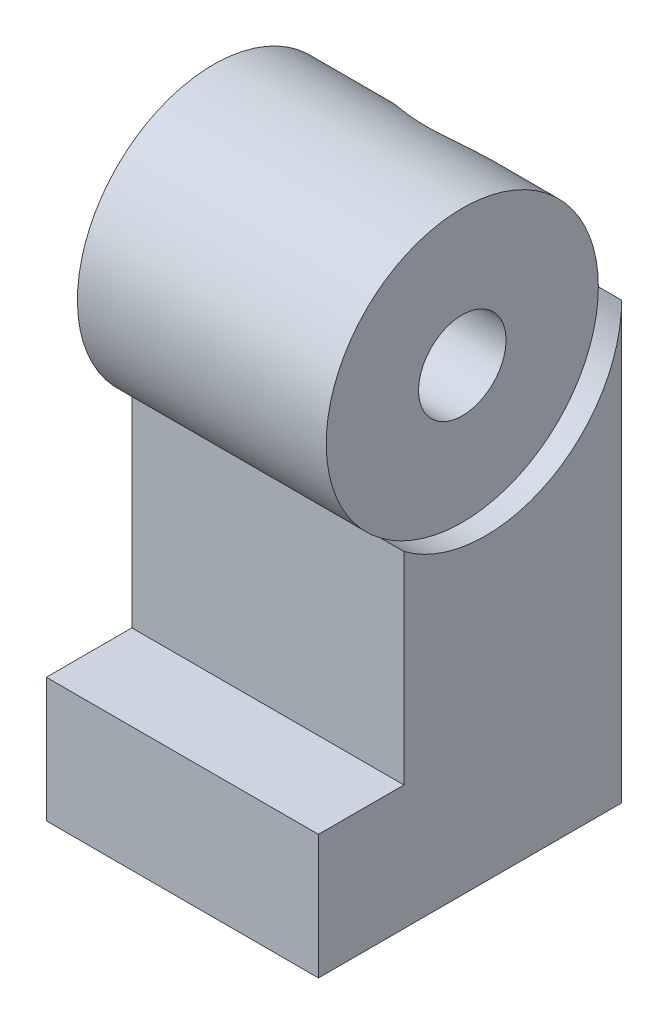
ISO-10303-21;
HEADER;
FILE_DESCRIPTION(('STEP AP214'),'2;1');
FILE_NAME('part.step','',(''),(''),'','','');
FILE_SCHEMA(('AUTOMOTIVE_DESIGN { 1 0 10303 214 1 1 1 1 }'));
ENDSEC;
DATA;
#1=APPLICATION_CONTEXT('core data for automotive mechanical design processes');
#2=APPLICATION_PROTOCOL_DEFINITION('international standard','automotive_design',2000,#1);
#3=PRODUCT_CONTEXT('',#1,'mechanical');
#4=PRODUCT('Part','Part','',(#3));
#5=PRODUCT_RELATED_PRODUCT_CATEGORY('part','',(#4));
#6=PRODUCT_DEFINITION_FORMATION('','',#4);
#7=PRODUCT_DEFINITION_CONTEXT('part definition',#1,'design');
#8=PRODUCT_DEFINITION('design','',#6,#7);
#9=PRODUCT_DEFINITION_SHAPE('','',#8);
#10=(LENGTH_UNIT() NAMED_UNIT(*) SI_UNIT(.MILLI.,.METRE.));
#11=(NAMED_UNIT(*) PLANE_ANGLE_UNIT() SI_UNIT($,.RADIAN.));
#12=(NAMED_UNIT(*) SI_UNIT($,.STERADIAN.) SOLID_ANGLE_UNIT());
#13=UNCERTAINTY_MEASURE_WITH_UNIT(LENGTH_MEASURE(1.E-05),#10,'distance_accuracy_value','');
#14=(GEOMETRIC_REPRESENTATION_CONTEXT(3) GLOBAL_UNCERTAINTY_ASSIGNED_CONTEXT((#13)) GLOBAL_UNIT_ASSIGNED_CONTEXT((#10,
#11,#12)) REPRESENTATION_CONTEXT('',''));
#15=CARTESIAN_POINT('',(0.,0.,0.));
#16=DIRECTION('',(0.,0.,1.));
#17=DIRECTION('',(1.,0.,0.));
#18=AXIS2_PLACEMENT_3D('',#15,#16,#17);
#19=CARTESIAN_POINT('',(-10.5,0.500000000000002,-1.7));
#20=DIRECTION('',(0.,0.,-1.));
#21=DIRECTION('',(0.,1.,0.));
#22=AXIS2_PLACEMENT_3D('',#19,#20,#21);
#23=PLANE('',#22);
#24=DIRECTION('',(1.,0.,0.));
#25=VECTOR('',#24,1.);
#26=CARTESIAN_POINT('',(-14.,2.2,-1.7));
#27=LINE('',#26,#25);
#28=CARTESIAN_POINT('',(-12.1941074346097,2.2,-1.7));
#29=VERTEX_POINT('',#28);
#30=CARTESIAN_POINT('',(-9.49410743460974,2.2,-1.7));
#31=VERTEX_POINT('',#30);
#32=EDGE_CURVE('E194',#29,#31,#27,.T.);
#33=ORIENTED_EDGE('',*,*,#32,.F.);
#34=CARTESIAN_POINT('',(-10.5,0.500000000000002,-1.7));
#35=DIRECTION('',(0.,0.,1.));
#36=DIRECTION('',(0.,1.,0.));
#37=AXIS2_PLACEMENT_3D('',#34,#35,#36);
#38=CIRCLE('',#37,2.4);
#39=CARTESIAN_POINT('',(-9.49410743460974,-1.67903192883734,-1.7));
#40=VERTEX_POINT('',#39);
#41=EDGE_CURVE('E196',#40,#29,#38,.T.);
#42=ORIENTED_EDGE('',*,*,#41,.F.);
#43=DIRECTION('',(0.,-1.,0.));
#44=VECTOR('',#43,1.);
#45=CARTESIAN_POINT('',(-9.49410743460974,0.,-1.7));
#46=LINE('',#45,#44);
#47=EDGE_CURVE('E186',#31,#40,#46,.T.);
#48=ORIENTED_EDGE('',*,*,#47,.F.);
#49=EDGE_LOOP('',(#33,#42,#48));
#50=FACE_BOUND('',#49,.T.);
#51=ADVANCED_FACE('F39',(#50),#23,.T.);
#52=CARTESIAN_POINT('',(-14.,-2.3,-1.8));
#53=DIRECTION('',(0.,0.,-1.));
#54=DIRECTION('',(0.,1.,0.));
#55=AXIS2_PLACEMENT_3D('',#52,#53,#54);
#56=PLANE('',#55);
#57=DIRECTION('',(0.,-1.,0.));
#58=VECTOR('',#57,1.);
#59=CARTESIAN_POINT('',(-12.9,-2.3,-1.8));
#60=LINE('',#59,#58);
#61=CARTESIAN_POINT('',(-12.9,-7.3,-1.8));
#62=VERTEX_POINT('',#61);
#63=CARTESIAN_POINT('',(-12.9,-11.2,-1.8));
#64=VERTEX_POINT('',#63);
#65=EDGE_CURVE('E452',#62,#64,#60,.T.);
#66=ORIENTED_EDGE('',*,*,#65,.T.);
#67=DIRECTION('',(-1.,0.,0.));
#68=VECTOR('',#67,1.);
#69=CARTESIAN_POINT('',(-14.,-11.2,-1.8));
#70=LINE('',#69,#68);
#71=CARTESIAN_POINT('',(-8.1,-11.2,-1.8));
#72=VERTEX_POINT('',#71);
#73=EDGE_CURVE('E468',#72,#64,#70,.T.);
#74=ORIENTED_EDGE('',*,*,#73,.F.);
#75=DIRECTION('',(0.,-1.,0.));
#76=VECTOR('',#75,1.);
#77=CARTESIAN_POINT('',(-8.1,-2.3,-1.8));
#78=LINE('',#77,#76);
#79=CARTESIAN_POINT('',(-8.1,-7.3,-1.8));
#80=VERTEX_POINT('',#79);
#81=EDGE_CURVE('E458',#80,#72,#78,.T.);
#82=ORIENTED_EDGE('',*,*,#81,.F.);
#83=CARTESIAN_POINT('',(-10.5,-7.3,-1.8));
#84=DIRECTION('',(0.,0.,1.));
#85=DIRECTION('',(0.,1.,0.));
#86=AXIS2_PLACEMENT_3D('',#83,#84,#85);
#87=CIRCLE('',#86,2.4);
#88=EDGE_CURVE('E289',#62,#80,#87,.T.);
#89=ORIENTED_EDGE('',*,*,#88,.F.);
#90=EDGE_LOOP('',(#66,#74,#82,#89));
#91=FACE_BOUND('',#90,.T.);
#92=ADVANCED_FACE('F250',(#91),#56,.F.);
#93=CARTESIAN_POINT('',(-7.,-11.2,0.));
#94=DIRECTION('',(0.,1.,0.));
#95=DIRECTION('',(0.,0.,1.));
#96=AXIS2_PLACEMENT_3D('',#93,#94,#95);
#97=PLANE('',#96);
#98=DIRECTION('',(0.,0.,1.));
#99=VECTOR('',#98,1.);
#100=CARTESIAN_POINT('',(-14.,-11.2,0.));
#101=LINE('',#100,#99);
#102=CARTESIAN_POINT('',(-14.,-11.2,-3.5));
#103=VERTEX_POINT('',#102);
#104=CARTESIAN_POINT('',(-14.,-11.2,4.3));
#105=VERTEX_POINT('',#104);
#106=EDGE_CURVE('E423',#103,#105,#101,.T.);
#107=ORIENTED_EDGE('',*,*,#106,.F.);
#108=DIRECTION('',(-1.,0.,0.));
#109=VECTOR('',#108,1.);
#110=CARTESIAN_POINT('',(-7.,-11.2,-3.5));
#111=LINE('',#110,#109);
#112=CARTESIAN_POINT('',(-7.,-11.2,-3.5));
#113=VERTEX_POINT('',#112);
#114=EDGE_CURVE('E382',#113,#103,#111,.T.);
#115=ORIENTED_EDGE('',*,*,#114,.F.);
#116=DIRECTION('',(0.,0.,1.));
#117=VECTOR('',#116,1.);
#118=CARTESIAN_POINT('',(-7.,-11.2,0.));
#119=LINE('',#118,#117);
#120=CARTESIAN_POINT('',(-7.,-11.2,4.3));
#121=VERTEX_POINT('',#120);
#122=EDGE_CURVE('E425',#113,#121,#119,.T.);
#123=ORIENTED_EDGE('',*,*,#122,.T.);
#124=DIRECTION('',(-1.,0.,0.));
#125=VECTOR('',#124,1.);
#126=CARTESIAN_POINT('',(-7.,-11.2,4.3));
#127=LINE('',#126,#125);
#128=EDGE_CURVE('E385',#121,#105,#127,.T.);
#129=ORIENTED_EDGE('',*,*,#128,.T.);
#130=EDGE_LOOP('',(#107,#115,#123,#129));
#131=FACE_BOUND('',#130,.T.);
#132=DIRECTION('',(0.,0.,1.));
#133=VECTOR('',#132,1.);
#134=CARTESIAN_POINT('',(-8.1,-11.2,0.));
#135=LINE('',#134,#133);
#136=CARTESIAN_POINT('',(-8.1,-11.2,2.9));
#137=VERTEX_POINT('',#136);
#138=EDGE_CURVE('E461',#72,#137,#135,.T.);
#139=ORIENTED_EDGE('',*,*,#138,.F.);
#140=ORIENTED_EDGE('',*,*,#73,.T.);
#141=DIRECTION('',(0.,0.,1.));
#142=VECTOR('',#141,1.);
#143=CARTESIAN_POINT('',(-12.9,-11.2,0.));
#144=LINE('',#143,#142);
#145=CARTESIAN_POINT('',(-12.9,-11.2,2.9));
#146=VERTEX_POINT('',#145);
#147=EDGE_CURVE('E465',#64,#146,#144,.T.);
#148=ORIENTED_EDGE('',*,*,#147,.T.);
#149=DIRECTION('',(-1.,0.,0.));
#150=VECTOR('',#149,1.);
#151=CARTESIAN_POINT('',(-14.,-11.2,2.9));
#152=LINE('',#151,#150);
#153=EDGE_CURVE('E297',#137,#146,#152,.T.);
#154=ORIENTED_EDGE('',*,*,#153,.F.);
#155=EDGE_LOOP('',(#139,#140,#148,#154));
#156=FACE_BOUND('',#155,.T.);
#157=ADVANCED_FACE('F256',(#131,#156),#97,.F.);
#158=CARTESIAN_POINT('',(-14.,-2.3,1.5));
#159=DIRECTION('',(0.,0.,-1.));
#160=DIRECTION('',(0.,1.,0.));
#161=AXIS2_PLACEMENT_3D('',#158,#159,#160);
#162=PLANE('',#161);
#163=DIRECTION('',(0.,-1.,0.));
#164=VECTOR('',#163,1.);
#165=CARTESIAN_POINT('',(-12.9,-2.3,1.5));
#166=LINE('',#165,#164);
#167=CARTESIAN_POINT('',(-12.9,-2.3,1.5));
#168=VERTEX_POINT('',#167);
#169=CARTESIAN_POINT('',(-12.9,-9.2,1.5));
#170=VERTEX_POINT('',#169);
#171=EDGE_CURVE('E451',#168,#170,#166,.T.);
#172=ORIENTED_EDGE('',*,*,#171,.F.);
#173=DIRECTION('',(-1.,0.,0.));
#174=VECTOR('',#173,1.);
#175=CARTESIAN_POINT('',(-14.,-2.3,1.5));
#176=LINE('',#175,#174);
#177=CARTESIAN_POINT('',(-8.1,-2.3,1.5));
#178=VERTEX_POINT('',#177);
#179=EDGE_CURVE('E474',#178,#168,#176,.T.);
#180=ORIENTED_EDGE('',*,*,#179,.F.);
#181=DIRECTION('',(0.,-1.,0.));
#182=VECTOR('',#181,1.);
#183=CARTESIAN_POINT('',(-8.1,-2.3,1.5));
#184=LINE('',#183,#182);
#185=CARTESIAN_POINT('',(-8.1,-9.2,1.5));
#186=VERTEX_POINT('',#185);
#187=EDGE_CURVE('E455',#178,#186,#184,.T.);
#188=ORIENTED_EDGE('',*,*,#187,.T.);
#189=DIRECTION('',(-1.,0.,0.));
#190=VECTOR('',#189,1.);
#191=CARTESIAN_POINT('',(-14.,-9.2,1.5));
#192=LINE('',#191,#190);
#193=EDGE_CURVE('E298',#186,#170,#192,.T.);
#194=ORIENTED_EDGE('',*,*,#193,.T.);
#195=EDGE_LOOP('',(#172,#180,#188,#194));
#196=FACE_BOUND('',#195,.T.);
#197=ADVANCED_FACE('F320',(#196),#162,.T.);
#198=CARTESIAN_POINT('',(-7.6,0.,0.));
#199=DIRECTION('',(-1.,0.,0.));
#200=DIRECTION('',(0.,0.,-1.));
#201=AXIS2_PLACEMENT_3D('',#198,#199,#200);
#202=CYLINDRICAL_SURFACE('',#201,3.5);
#203=CARTESIAN_POINT('',(-8.1526610811389,0.,-3.5));
#204=CARTESIAN_POINT('',(-8.14047675200788,0.0571477217374245,-3.50001181867057));
#205=CARTESIAN_POINT('',(-8.13040136066602,0.114743770065322,-3.49860061614223));
#206=CARTESIAN_POINT('',(-8.11448439571622,0.230360407827148,-3.49288728833139));
#207=CARTESIAN_POINT('',(-8.10864171215917,0.288380881929227,-3.48858592151156));
#208=CARTESIAN_POINT('',(-8.1012199261076,0.404089359673819,-3.47707880110764));
#209=CARTESIAN_POINT('',(-8.09961781879924,0.461777456069779,-3.46988896332483));
#210=CARTESIAN_POINT('',(-8.10053621615343,0.576676567862824,-3.45265487837301));
#211=CARTESIAN_POINT('',(-8.10305673592038,0.633887581511211,-3.44261062074615));
#212=CARTESIAN_POINT('',(-8.11663404443771,0.804105036209103,-3.4083356117771));
#213=CARTESIAN_POINT('',(-8.13369615772365,0.915869866292524,-3.37994514796454));
#214=CARTESIAN_POINT('',(-8.1823353397836,1.13314832429677,-3.31344895138059));
#215=CARTESIAN_POINT('',(-8.21392769463075,1.23865523648251,-3.27533300607753));
#216=CARTESIAN_POINT('',(-8.29190508371705,1.44731564674367,-3.18884504357403));
#217=CARTESIAN_POINT('',(-8.33902161100718,1.55000373794561,-3.14001706082533));
#218=CARTESIAN_POINT('',(-8.44532329958775,1.74526360748642,-3.03584021966201));
#219=CARTESIAN_POINT('',(-8.50451350227335,1.83783113507598,-2.98048864139242));
#220=CARTESIAN_POINT('',(-8.64646426223189,2.03018562272158,-2.85379750966277));
#221=CARTESIAN_POINT('',(-8.73157013043013,2.12760502281981,-2.78149734246403));
#222=CARTESIAN_POINT('',(-8.91528339944795,2.30698502977076,-2.63462775579363));
#223=CARTESIAN_POINT('',(-9.01390834423533,2.38892521486053,-2.56005548720432));
#224=CARTESIAN_POINT('',(-9.21673536669363,2.53162908276111,-2.41871956278776));
#225=CARTESIAN_POINT('',(-9.32004698623315,2.59348192527748,-2.3517770338946));
#226=CARTESIAN_POINT('',(-9.53861548919004,2.70240840583052,-2.22572729179699));
#227=CARTESIAN_POINT('',(-9.65384596463766,2.74951382379002,-2.16660339102304));
#228=CARTESIAN_POINT('',(-9.85227242287299,2.81234304649958,-2.08383834027692));
#229=CARTESIAN_POINT('',(-9.93168132527571,2.83323788763357,-2.05514190190293));
#230=CARTESIAN_POINT('',(-10.0950061812703,2.86704539023275,-2.0077106103014));
#231=CARTESIAN_POINT('',(-10.1789117234325,2.87997569256307,-1.98895375460871));
#232=CARTESIAN_POINT('',(-10.3505087916052,2.89690144617538,-1.9642337035912));
#233=CARTESIAN_POINT('',(-10.4382310509638,2.9008005995437,-1.95840842288825));
#234=CARTESIAN_POINT('',(-10.6133473871773,2.89892227463507,-1.96118525247281));
#235=CARTESIAN_POINT('',(-10.7007413623174,2.89314201115589,-1.96979151536345));
#236=CARTESIAN_POINT('',(-10.8800242698423,2.87160130715171,-2.0010690476172));
#237=CARTESIAN_POINT('',(-10.9715818427135,2.85496763238069,-2.02496702821198));
#238=CARTESIAN_POINT('',(-11.1489468256999,2.81241019263364,-2.08366151371945));
#239=CARTESIAN_POINT('',(-11.2347363992214,2.78645905439294,-2.11849009267811));
#240=CARTESIAN_POINT('',(-11.3822692098759,2.73301571417906,-2.18679788954712));
#241=CARTESIAN_POINT('',(-11.4452127656868,2.70705840232988,-2.21895300854011));
#242=CARTESIAN_POINT('',(-11.5674604731173,2.6505953738598,-2.28610481874925));
#243=CARTESIAN_POINT('',(-11.6267625061417,2.62008704424715,-2.32110313711189));
#244=CARTESIAN_POINT('',(-11.799540313855,2.52207206221612,-2.42868720689748));
#245=CARTESIAN_POINT('',(-11.9078190013849,2.4481010718627,-2.50382746204863));
#246=CARTESIAN_POINT('',(-12.116391766698,2.27939132717921,-2.65861963929727));
#247=CARTESIAN_POINT('',(-12.215921870984,2.18373583955497,-2.73829291655651));
#248=CARTESIAN_POINT('',(-12.3986265955026,1.97459276266238,-2.89271972414266));
#249=CARTESIAN_POINT('',(-12.4818252075184,1.86113177857626,-2.96748036225121));
#250=CARTESIAN_POINT('',(-12.6172923530373,1.63641660452187,-3.09615262794245));
#251=CARTESIAN_POINT('',(-12.6723756023832,1.52768128659246,-3.1514891082545));
#252=CARTESIAN_POINT('',(-12.7664416280668,1.29903752936263,-3.25238946581503));
#253=CARTESIAN_POINT('',(-12.8054291648446,1.17913240650189,-3.29795623061858));
#254=CARTESIAN_POINT('',(-12.8498291454817,0.992412245075312,-3.35700281785587));
#255=CARTESIAN_POINT('',(-12.8623092388427,0.928685601014828,-3.37520301505509));
#256=CARTESIAN_POINT('',(-12.8821249110229,0.799562026687038,-3.40809707788925));
#257=CARTESIAN_POINT('',(-12.889463298649,0.734166028622356,-3.42279285501696));
#258=CARTESIAN_POINT('',(-12.8987251857968,0.602361890113004,-3.44842924317227));
#259=CARTESIAN_POINT('',(-12.9006564161378,0.535955331323925,-3.45937519578144));
#260=CARTESIAN_POINT('',(-12.8989518663615,0.402723056835077,-3.47740236223998));
#261=CARTESIAN_POINT('',(-12.8953197945145,0.335897649885479,-3.4844861461866));
#262=CARTESIAN_POINT('',(-12.8845146258116,0.224046580330875,-3.49311564200003));
#263=CARTESIAN_POINT('',(-12.878862876526,0.178946589127802,-3.49571088870466));
#264=CARTESIAN_POINT('',(-12.8650076462582,0.0891432677126932,-3.49915350020635));
#265=CARTESIAN_POINT('',(-12.8568080591319,0.0444394385561719,-3.50000351725482));
#266=CARTESIAN_POINT('',(-12.8473389188611,0.,-3.5));
#267=B_SPLINE_CURVE_WITH_KNOTS('',3,(#203,#204,#205,#206,#207,#208,#209,#210,#211,#212,#213,
#214,#215,#216,#217,#218,#219,#220,#221,#222,#223,#224,#225,#226,#227,#228,#229,#230,#231,#232,
#233,#234,#235,#236,#237,#238,#239,#240,#241,#242,#243,#244,#245,#246,#247,#248,#249,#250,#251,
#252,#253,#254,#255,#256,#257,#258,#259,#260,#261,#262,#263,#264,#265,#266),.UNSPECIFIED.,.F.,
.F.,(4,2,2,2,2,2,2,2,2,2,2,2,2,2,2,2,2,2,2,2,2,2,2,2,2,2,2,2,2,2,2,4),(0.,0.175237440381033,
0.35042891134353,0.524668014814338,0.698907756660255,1.04686867533735,1.39519649537508,
1.76309807782818,2.13115359418281,2.57414809278723,3.01772301461145,3.42986501795747,
3.84111266440891,4.10124897819194,4.36080701764205,4.62312019539684,4.88550886538463,
5.17215450827924,5.45964925644542,5.68524281978454,5.91096641102047,6.36265437457839,
6.83912330739456,7.31488695708917,7.71498529590946,8.1149652174138,8.31702682714792,
8.51897796858323,8.720640224955,8.92216811998134,9.0586481727044,9.19492066068159),.UNSPECIFIED.);
#268=CARTESIAN_POINT('',(-8.1526610811389,0.,-3.5));
#269=VERTEX_POINT('',#268);
#270=CARTESIAN_POINT('',(-12.8473389188611,0.,-3.5));
#271=VERTEX_POINT('',#270);
#272=EDGE_CURVE('E290',#269,#271,#267,.T.);
#273=ORIENTED_EDGE('',*,*,#272,.T.);
#274=DIRECTION('',(-1.,0.,0.));
#275=VECTOR('',#274,1.);
#276=CARTESIAN_POINT('',(-7.,0.,-3.5));
#277=LINE('',#276,#275);
#278=CARTESIAN_POINT('',(-14.,0.,-3.5));
#279=VERTEX_POINT('',#278);
#280=EDGE_CURVE('E378',#271,#279,#277,.T.);
#281=ORIENTED_EDGE('',*,*,#280,.T.);
#282=CARTESIAN_POINT('',(-14.,0.,0.));
#283=DIRECTION('',(1.,0.,0.));
#284=DIRECTION('',(0.,0.,-1.));
#285=AXIS2_PLACEMENT_3D('',#282,#283,#284);
#286=CIRCLE('',#285,3.5);
#287=CARTESIAN_POINT('',(-14.,-2.8,2.1));
#288=VERTEX_POINT('',#287);
#289=EDGE_CURVE('E51',#279,#288,#286,.T.);
#290=ORIENTED_EDGE('',*,*,#289,.T.);
#291=DIRECTION('',(-1.,0.,0.));
#292=VECTOR('',#291,1.);
#293=CARTESIAN_POINT('',(-7.,-2.8,2.1));
#294=LINE('',#293,#292);
#295=CARTESIAN_POINT('',(-7.6,-2.8,2.1));
#296=VERTEX_POINT('',#295);
#297=EDGE_CURVE('E413',#296,#288,#294,.T.);
#298=ORIENTED_EDGE('',*,*,#297,.F.);
#299=CARTESIAN_POINT('',(-7.6,0.,0.));
#300=DIRECTION('',(1.,0.,0.));
#301=DIRECTION('',(0.,0.,-1.));
#302=AXIS2_PLACEMENT_3D('',#299,#300,#301);
#303=CIRCLE('',#302,3.5);
#304=CARTESIAN_POINT('',(-7.6,0.,-3.5));
#305=VERTEX_POINT('',#304);
#306=EDGE_CURVE('E12',#305,#296,#303,.T.);
#307=ORIENTED_EDGE('',*,*,#306,.F.);
#308=EDGE_CURVE('E381',#305,#269,#277,.T.);
#309=ORIENTED_EDGE('',*,*,#308,.T.);
#310=EDGE_LOOP('',(#273,#281,#290,#298,#307,#309));
#311=FACE_BOUND('',#310,.T.);
#312=ADVANCED_FACE('F41',(#311),#202,.T.);
#313=CARTESIAN_POINT('',(-7.6,0.,0.));
#314=DIRECTION('',(-1.,0.,0.));
#315=DIRECTION('',(0.,0.,-1.));
#316=AXIS2_PLACEMENT_3D('',#313,#314,#315);
#317=PLANE('',#316);
#318=CARTESIAN_POINT('',(-7.6,0.,0.));
#319=DIRECTION('',(-1.,0.,0.));
#320=DIRECTION('',(0.,0.,1.));
#321=AXIS2_PLACEMENT_3D('',#318,#319,#320);
#322=CIRCLE('',#321,1.125);
#323=CARTESIAN_POINT('',(-7.6,0.,1.125));
#324=VERTEX_POINT('',#323);
#325=EDGE_CURVE('E204',#324,#324,#322,.T.);
#326=ORIENTED_EDGE('',*,*,#325,.T.);
#327=EDGE_LOOP('',(#326));
#328=FACE_BOUND('',#327,.T.);
#329=ORIENTED_EDGE('',*,*,#306,.T.);
#330=CARTESIAN_POINT('',(-7.6,0.,0.));
#331=DIRECTION('',(1.,0.,0.));
#332=DIRECTION('',(0.,0.,-1.));
#333=AXIS2_PLACEMENT_3D('',#330,#331,#332);
#334=CIRCLE('',#333,3.5);
#335=EDGE_CURVE('E376',#296,#305,#334,.T.);
#336=ORIENTED_EDGE('',*,*,#335,.T.);
#337=EDGE_LOOP('',(#329,#336));
#338=FACE_BOUND('',#337,.T.);
#339=ADVANCED_FACE('F357',(#328,#338),#317,.F.);
#340=CARTESIAN_POINT('',(-14.,0.,0.));
#341=DIRECTION('',(-1.,0.,0.));
#342=DIRECTION('',(0.,0.,-1.));
#343=AXIS2_PLACEMENT_3D('',#340,#341,#342);
#344=PLANE('',#343);
#345=ORIENTED_EDGE('',*,*,#289,.F.);
#346=DIRECTION('',(0.,-1.,0.));
#347=VECTOR('',#346,1.);
#348=CARTESIAN_POINT('',(-14.,0.,-3.5));
#349=LINE('',#348,#347);
#350=EDGE_CURVE('E368',#279,#103,#349,.T.);
#351=ORIENTED_EDGE('',*,*,#350,.T.);
#352=ORIENTED_EDGE('',*,*,#106,.T.);
#353=DIRECTION('',(0.,1.,0.));
#354=VECTOR('',#353,1.);
#355=CARTESIAN_POINT('',(-14.,0.,4.3));
#356=LINE('',#355,#354);
#357=CARTESIAN_POINT('',(-14.,-8.,4.3));
#358=VERTEX_POINT('',#357);
#359=EDGE_CURVE('E428',#105,#358,#356,.T.);
#360=ORIENTED_EDGE('',*,*,#359,.T.);
#361=DIRECTION('',(0.,0.,-1.));
#362=VECTOR('',#361,1.);
#363=CARTESIAN_POINT('',(-14.,-8.,0.));
#364=LINE('',#363,#362);
#365=CARTESIAN_POINT('',(-14.,-8.,2.1));
#366=VERTEX_POINT('',#365);
#367=EDGE_CURVE('E431',#358,#366,#364,.T.);
#368=ORIENTED_EDGE('',*,*,#367,.T.);
#369=DIRECTION('',(0.,1.,0.));
#370=VECTOR('',#369,1.);
#371=CARTESIAN_POINT('',(-14.,0.,2.1));
#372=LINE('',#371,#370);
#373=EDGE_CURVE('E372',#366,#288,#372,.T.);
#374=ORIENTED_EDGE('',*,*,#373,.T.);
#375=EDGE_LOOP('',(#345,#351,#352,#360,#368,#374));
#376=FACE_BOUND('',#375,.T.);
#377=ADVANCED_FACE('F355',(#376),#344,.T.);
#378=CARTESIAN_POINT('',(-7.,0.,0.));
#379=DIRECTION('',(-1.,0.,0.));
#380=DIRECTION('',(0.,0.,-1.));
#381=AXIS2_PLACEMENT_3D('',#378,#379,#380);
#382=CYLINDRICAL_SURFACE('',#381,3.5);
#383=CARTESIAN_POINT('',(-7.,-2.8,2.1));
#384=VERTEX_POINT('',#383);
#385=EDGE_CURVE('E396',#384,#296,#294,.T.);
#386=ORIENTED_EDGE('',*,*,#385,.F.);
#387=CARTESIAN_POINT('',(-7.,0.,0.));
#388=DIRECTION('',(1.,0.,0.));
#389=DIRECTION('',(0.,0.,-1.));
#390=AXIS2_PLACEMENT_3D('',#387,#388,#389);
#391=CIRCLE('',#390,3.5);
#392=CARTESIAN_POINT('',(-7.,0.,-3.5));
#393=VERTEX_POINT('',#392);
#394=EDGE_CURVE('E430',#384,#393,#391,.T.);
#395=ORIENTED_EDGE('',*,*,#394,.T.);
#396=EDGE_CURVE('E384',#393,#305,#277,.T.);
#397=ORIENTED_EDGE('',*,*,#396,.T.);
#398=ORIENTED_EDGE('',*,*,#335,.F.);
#399=EDGE_LOOP('',(#386,#395,#397,#398));
#400=FACE_BOUND('',#399,.T.);
#401=ADVANCED_FACE('F338',(#400),#382,.F.);
#402=CARTESIAN_POINT('',(-7.,0.,-3.5));
#403=DIRECTION('',(0.,0.,1.));
#404=DIRECTION('',(0.,-1.,0.));
#405=AXIS2_PLACEMENT_3D('',#402,#403,#404);
#406=PLANE('',#405);
#407=CARTESIAN_POINT('',(-10.5,-7.3,-3.5));
#408=DIRECTION('',(0.,0.,1.));
#409=DIRECTION('',(0.,1.,0.));
#410=AXIS2_PLACEMENT_3D('',#407,#408,#409);
#411=CIRCLE('',#410,2.4);
#412=CARTESIAN_POINT('',(-10.5,-4.9,-3.5));
#413=VERTEX_POINT('',#412);
#414=EDGE_CURVE('E282',#413,#413,#411,.T.);
#415=ORIENTED_EDGE('',*,*,#414,.T.);
#416=EDGE_LOOP('',(#415));
#417=FACE_BOUND('',#416,.T.);
#418=ORIENTED_EDGE('',*,*,#308,.F.);
#419=ORIENTED_EDGE('',*,*,#396,.F.);
#420=DIRECTION('',(0.,-1.,0.));
#421=VECTOR('',#420,1.);
#422=CARTESIAN_POINT('',(-7.,0.,-3.5));
#423=LINE('',#422,#421);
#424=EDGE_CURVE('E437',#393,#113,#423,.T.);
#425=ORIENTED_EDGE('',*,*,#424,.T.);
#426=ORIENTED_EDGE('',*,*,#114,.T.);
#427=ORIENTED_EDGE('',*,*,#350,.F.);
#428=ORIENTED_EDGE('',*,*,#280,.F.);
#429=CARTESIAN_POINT('',(-10.5,0.500000000000002,-3.5));
#430=DIRECTION('',(0.,0.,1.));
#431=DIRECTION('',(0.,1.,0.));
#432=AXIS2_PLACEMENT_3D('',#429,#430,#431);
#433=CIRCLE('',#432,2.4);
#434=EDGE_CURVE('E66',#271,#269,#433,.T.);
#435=ORIENTED_EDGE('',*,*,#434,.T.);
#436=EDGE_LOOP('',(#418,#419,#425,#426,#427,#428,#435));
#437=FACE_BOUND('',#436,.T.);
#438=ADVANCED_FACE('F334',(#417,#437),#406,.F.);
#439=CARTESIAN_POINT('',(-7.,0.,4.3));
#440=DIRECTION('',(0.,0.,-1.));
#441=DIRECTION('',(0.,1.,0.));
#442=AXIS2_PLACEMENT_3D('',#439,#440,#441);
#443=PLANE('',#442);
#444=ORIENTED_EDGE('',*,*,#359,.F.);
#445=ORIENTED_EDGE('',*,*,#128,.F.);
#446=DIRECTION('',(0.,1.,0.));
#447=VECTOR('',#446,1.);
#448=CARTESIAN_POINT('',(-7.,0.,4.3));
#449=LINE('',#448,#447);
#450=CARTESIAN_POINT('',(-7.,-8.,4.3));
#451=VERTEX_POINT('',#450);
#452=EDGE_CURVE('E440',#121,#451,#449,.T.);
#453=ORIENTED_EDGE('',*,*,#452,.T.);
#454=DIRECTION('',(-1.,0.,0.));
#455=VECTOR('',#454,1.);
#456=CARTESIAN_POINT('',(-7.,-8.,4.3));
#457=LINE('',#456,#455);
#458=EDGE_CURVE('E415',#451,#358,#457,.T.);
#459=ORIENTED_EDGE('',*,*,#458,.T.);
#460=EDGE_LOOP('',(#444,#445,#453,#459));
#461=FACE_BOUND('',#460,.T.);
#462=ADVANCED_FACE('F337',(#461),#443,.F.);
#463=CARTESIAN_POINT('',(-7.,-8.,0.));
#464=DIRECTION('',(0.,-1.,0.));
#465=DIRECTION('',(0.,0.,-1.));
#466=AXIS2_PLACEMENT_3D('',#463,#464,#465);
#467=PLANE('',#466);
#468=ORIENTED_EDGE('',*,*,#367,.F.);
#469=ORIENTED_EDGE('',*,*,#458,.F.);
#470=DIRECTION('',(0.,0.,-1.));
#471=VECTOR('',#470,1.);
#472=CARTESIAN_POINT('',(-7.,-8.,0.));
#473=LINE('',#472,#471);
#474=CARTESIAN_POINT('',(-7.,-8.,2.1));
#475=VERTEX_POINT('',#474);
#476=EDGE_CURVE('E442',#451,#475,#473,.T.);
#477=ORIENTED_EDGE('',*,*,#476,.T.);
#478=DIRECTION('',(-1.,0.,0.));
#479=VECTOR('',#478,1.);
#480=CARTESIAN_POINT('',(-7.,-8.,2.1));
#481=LINE('',#480,#479);
#482=EDGE_CURVE('E412',#475,#366,#481,.T.);
#483=ORIENTED_EDGE('',*,*,#482,.T.);
#484=EDGE_LOOP('',(#468,#469,#477,#483));
#485=FACE_BOUND('',#484,.T.);
#486=ADVANCED_FACE('F345',(#485),#467,.F.);
#487=CARTESIAN_POINT('',(-7.,0.,2.1));
#488=DIRECTION('',(0.,0.,-1.));
#489=DIRECTION('',(0.,1.,0.));
#490=AXIS2_PLACEMENT_3D('',#487,#488,#489);
#491=PLANE('',#490);
#492=ORIENTED_EDGE('',*,*,#373,.F.);
#493=ORIENTED_EDGE('',*,*,#482,.F.);
#494=DIRECTION('',(0.,1.,0.));
#495=VECTOR('',#494,1.);
#496=CARTESIAN_POINT('',(-7.,0.,2.1));
#497=LINE('',#496,#495);
#498=EDGE_CURVE('E445',#475,#384,#497,.T.);
#499=ORIENTED_EDGE('',*,*,#498,.T.);
#500=ORIENTED_EDGE('',*,*,#385,.T.);
#501=ORIENTED_EDGE('',*,*,#297,.T.);
#502=EDGE_LOOP('',(#492,#493,#499,#500,#501));
#503=FACE_BOUND('',#502,.T.);
#504=ADVANCED_FACE('F332',(#503),#491,.F.);
#505=CARTESIAN_POINT('',(-7.,0.,0.));
#506=DIRECTION('',(-1.,0.,0.));
#507=DIRECTION('',(0.,0.,-1.));
#508=AXIS2_PLACEMENT_3D('',#505,#506,#507);
#509=PLANE('',#508);
#510=ORIENTED_EDGE('',*,*,#394,.F.);
#511=ORIENTED_EDGE('',*,*,#498,.F.);
#512=ORIENTED_EDGE('',*,*,#476,.F.);
#513=ORIENTED_EDGE('',*,*,#452,.F.);
#514=ORIENTED_EDGE('',*,*,#122,.F.);
#515=ORIENTED_EDGE('',*,*,#424,.F.);
#516=EDGE_LOOP('',(#510,#511,#512,#513,#514,#515));
#517=FACE_BOUND('',#516,.T.);
#518=ADVANCED_FACE('F328',(#517),#509,.F.);
#519=CARTESIAN_POINT('',(-8.1,-2.3,-1.8));
#520=VERTEX_POINT('',#519);
#521=EDGE_CURVE('E436',#520,#80,#78,.T.);
#522=ORIENTED_EDGE('',*,*,#521,.F.);
#523=DIRECTION('',(-1.,0.,0.));
#524=VECTOR('',#523,1.);
#525=CARTESIAN_POINT('',(-14.,-2.3,-1.8));
#526=LINE('',#525,#524);
#527=CARTESIAN_POINT('',(-12.9,-2.3,-1.8));
#528=VERTEX_POINT('',#527);
#529=EDGE_CURVE('E464',#520,#528,#526,.T.);
#530=ORIENTED_EDGE('',*,*,#529,.T.);
#531=EDGE_CURVE('E448',#528,#62,#60,.T.);
#532=ORIENTED_EDGE('',*,*,#531,.T.);
#533=EDGE_CURVE('E285',#80,#62,#87,.T.);
#534=ORIENTED_EDGE('',*,*,#533,.F.);
#535=EDGE_LOOP('',(#522,#530,#532,#534));
#536=FACE_BOUND('',#535,.T.);
#537=ADVANCED_FACE('F259',(#536),#56,.F.);
#538=CARTESIAN_POINT('',(-8.1,-2.3,0.));
#539=DIRECTION('',(-1.,0.,0.));
#540=DIRECTION('',(0.,0.,-1.));
#541=AXIS2_PLACEMENT_3D('',#538,#539,#540);
#542=PLANE('',#541);
#543=ORIENTED_EDGE('',*,*,#81,.T.);
#544=ORIENTED_EDGE('',*,*,#138,.T.);
#545=DIRECTION('',(0.,-1.,0.));
#546=VECTOR('',#545,1.);
#547=CARTESIAN_POINT('',(-8.1,-9.2,2.9));
#548=LINE('',#547,#546);
#549=CARTESIAN_POINT('',(-8.1,-9.2,2.9));
#550=VERTEX_POINT('',#549);
#551=EDGE_CURVE('E471',#550,#137,#548,.T.);
#552=ORIENTED_EDGE('',*,*,#551,.F.);
#553=DIRECTION('',(0.,0.,1.));
#554=VECTOR('',#553,1.);
#555=CARTESIAN_POINT('',(-8.1,-9.2,0.));
#556=LINE('',#555,#554);
#557=EDGE_CURVE('E483',#186,#550,#556,.T.);
#558=ORIENTED_EDGE('',*,*,#557,.F.);
#559=ORIENTED_EDGE('',*,*,#187,.F.);
#560=DIRECTION('',(0.,0.,1.));
#561=VECTOR('',#560,1.);
#562=CARTESIAN_POINT('',(-8.1,-2.3,0.));
#563=LINE('',#562,#561);
#564=EDGE_CURVE('E472',#520,#178,#563,.T.);
#565=ORIENTED_EDGE('',*,*,#564,.F.);
#566=ORIENTED_EDGE('',*,*,#521,.T.);
#567=EDGE_LOOP('',(#543,#544,#552,#558,#559,#565,#566));
#568=FACE_BOUND('',#567,.T.);
#569=ADVANCED_FACE('F316',(#568),#542,.T.);
#570=CARTESIAN_POINT('',(-12.9,-2.3,0.));
#571=DIRECTION('',(-1.,0.,0.));
#572=DIRECTION('',(0.,0.,-1.));
#573=AXIS2_PLACEMENT_3D('',#570,#571,#572);
#574=PLANE('',#573);
#575=ORIENTED_EDGE('',*,*,#531,.F.);
#576=DIRECTION('',(0.,0.,1.));
#577=VECTOR('',#576,1.);
#578=CARTESIAN_POINT('',(-12.9,-2.3,0.));
#579=LINE('',#578,#577);
#580=EDGE_CURVE('E477',#528,#168,#579,.T.);
#581=ORIENTED_EDGE('',*,*,#580,.T.);
#582=ORIENTED_EDGE('',*,*,#171,.T.);
#583=DIRECTION('',(0.,0.,1.));
#584=VECTOR('',#583,1.);
#585=CARTESIAN_POINT('',(-12.9,-9.2,0.));
#586=LINE('',#585,#584);
#587=CARTESIAN_POINT('',(-12.9,-9.2,2.9));
#588=VERTEX_POINT('',#587);
#589=EDGE_CURVE('E490',#170,#588,#586,.T.);
#590=ORIENTED_EDGE('',*,*,#589,.T.);
#591=DIRECTION('',(0.,-1.,0.));
#592=VECTOR('',#591,1.);
#593=CARTESIAN_POINT('',(-12.9,-9.2,2.9));
#594=LINE('',#593,#592);
#595=EDGE_CURVE('E481',#588,#146,#594,.T.);
#596=ORIENTED_EDGE('',*,*,#595,.T.);
#597=ORIENTED_EDGE('',*,*,#147,.F.);
#598=ORIENTED_EDGE('',*,*,#65,.F.);
#599=EDGE_LOOP('',(#575,#581,#582,#590,#596,#597,#598));
#600=FACE_BOUND('',#599,.T.);
#601=ADVANCED_FACE('F314',(#600),#574,.F.);
#602=CARTESIAN_POINT('',(-14.,-2.3,0.));
#603=DIRECTION('',(0.,-1.,0.));
#604=DIRECTION('',(0.,0.,-1.));
#605=AXIS2_PLACEMENT_3D('',#602,#603,#604);
#606=PLANE('',#605);
#607=ORIENTED_EDGE('',*,*,#529,.F.);
#608=ORIENTED_EDGE('',*,*,#564,.T.);
#609=ORIENTED_EDGE('',*,*,#179,.T.);
#610=ORIENTED_EDGE('',*,*,#580,.F.);
#611=EDGE_LOOP('',(#607,#608,#609,#610));
#612=FACE_BOUND('',#611,.T.);
#613=ADVANCED_FACE('F310',(#612),#606,.T.);
#614=CARTESIAN_POINT('',(-14.,-9.2,2.9));
#615=DIRECTION('',(0.,0.,-1.));
#616=DIRECTION('',(0.,1.,0.));
#617=AXIS2_PLACEMENT_3D('',#614,#615,#616);
#618=PLANE('',#617);
#619=ORIENTED_EDGE('',*,*,#153,.T.);
#620=ORIENTED_EDGE('',*,*,#595,.F.);
#621=DIRECTION('',(-1.,0.,0.));
#622=VECTOR('',#621,1.);
#623=CARTESIAN_POINT('',(-14.,-9.2,2.9));
#624=LINE('',#623,#622);
#625=EDGE_CURVE('E489',#550,#588,#624,.T.);
#626=ORIENTED_EDGE('',*,*,#625,.F.);
#627=ORIENTED_EDGE('',*,*,#551,.T.);
#628=EDGE_LOOP('',(#619,#620,#626,#627));
#629=FACE_BOUND('',#628,.T.);
#630=ADVANCED_FACE('F306',(#629),#618,.T.);
#631=CARTESIAN_POINT('',(-14.,-9.2,0.));
#632=DIRECTION('',(0.,-1.,0.));
#633=DIRECTION('',(0.,0.,-1.));
#634=AXIS2_PLACEMENT_3D('',#631,#632,#633);
#635=PLANE('',#634);
#636=ORIENTED_EDGE('',*,*,#193,.F.);
#637=ORIENTED_EDGE('',*,*,#557,.T.);
#638=ORIENTED_EDGE('',*,*,#625,.T.);
#639=ORIENTED_EDGE('',*,*,#589,.F.);
#640=EDGE_LOOP('',(#636,#637,#638,#639));
#641=FACE_BOUND('',#640,.T.);
#642=ADVANCED_FACE('F302',(#641),#635,.T.);
#643=CARTESIAN_POINT('',(-10.5,-7.3,-1.7));
#644=DIRECTION('',(0.,0.,-1.));
#645=DIRECTION('',(0.,1.,0.));
#646=AXIS2_PLACEMENT_3D('',#643,#644,#645);
#647=CYLINDRICAL_SURFACE('',#646,2.4);
#648=ORIENTED_EDGE('',*,*,#414,.F.);
#649=EDGE_LOOP('',(#648));
#650=FACE_BOUND('',#649,.T.);
#651=ORIENTED_EDGE('',*,*,#533,.T.);
#652=ORIENTED_EDGE('',*,*,#88,.T.);
#653=EDGE_LOOP('',(#651,#652));
#654=FACE_BOUND('',#653,.T.);
#655=ADVANCED_FACE('F268',(#650,#654),#647,.F.);
#656=CARTESIAN_POINT('',(-10.5,0.500000000000002,-1.7));
#657=DIRECTION('',(0.,0.,-1.));
#658=DIRECTION('',(0.,1.,0.));
#659=AXIS2_PLACEMENT_3D('',#656,#657,#658);
#660=CYLINDRICAL_SURFACE('',#659,2.4);
#661=ORIENTED_EDGE('',*,*,#272,.F.);
#662=ORIENTED_EDGE('',*,*,#434,.F.);
#663=EDGE_LOOP('',(#661,#662));
#664=FACE_BOUND('',#663,.T.);
#665=CARTESIAN_POINT('',(-12.1941074346097,-1.2,-1.7));
#666=VERTEX_POINT('',#665);
#667=EDGE_CURVE('E273',#29,#666,#38,.T.);
#668=ORIENTED_EDGE('',*,*,#667,.T.);
#669=DIRECTION('',(0.,0.,-1.));
#670=VECTOR('',#669,1.);
#671=CARTESIAN_POINT('',(-12.1941074346097,-1.2,6.701));
#672=LINE('',#671,#670);
#673=CARTESIAN_POINT('',(-12.1941074346097,-1.2,1.96214168703486));
#674=VERTEX_POINT('',#673);
#675=EDGE_CURVE('E277',#674,#666,#672,.T.);
#676=ORIENTED_EDGE('',*,*,#675,.F.);
#677=CARTESIAN_POINT('',(-12.1941074346097,-1.2,1.96214168703486));
#678=CARTESIAN_POINT('',(-12.1418876496675,-1.25200974738039,1.93034342687488));
#679=CARTESIAN_POINT('',(-12.0876847789849,-1.30126071437639,1.89737290013413));
#680=CARTESIAN_POINT('',(-11.9754817811585,-1.39427857563876,1.83010183875141));
#681=CARTESIAN_POINT('',(-11.9174802770501,-1.43804346432022,1.79580082367912));
#682=CARTESIAN_POINT('',(-11.7992687933421,-1.51913703482202,1.72770382984711));
#683=CARTESIAN_POINT('',(-11.7391407977777,-1.55659105595429,1.69391449210442));
#684=CARTESIAN_POINT('',(-11.615477315453,-1.62620388782074,1.62720223933702));
#685=CARTESIAN_POINT('',(-11.5519431848454,-1.65836478555715,1.59427898714991));
#686=CARTESIAN_POINT('',(-11.415857249859,-1.71973972043444,1.52796699449234));
#687=CARTESIAN_POINT('',(-11.3429952435628,-1.74848452080668,1.49476829380877));
#688=CARTESIAN_POINT('',(-11.1919888130428,-1.79946266655315,1.43304186301554));
#689=CARTESIAN_POINT('',(-11.113789377545,-1.82160936127315,1.40457829033614));
#690=CARTESIAN_POINT('',(-11.0332916650389,-1.84,1.38));
#691=B_SPLINE_CURVE_WITH_KNOTS('',3,(#677,#678,#679,#680,#681,#682,#683,#684,#685,#686,#687,
#688,#689,#690),.UNSPECIFIED.,.F.,.F.,(4,2,2,2,2,2,4),(0.,0.240678924500241,0.481445580692789,
0.716649637191048,0.951760732793326,1.20647363040687,1.46439741701102),.UNSPECIFIED.);
#692=CARTESIAN_POINT('',(-11.0332916650389,-1.84,1.38));
#693=VERTEX_POINT('',#692);
#694=EDGE_CURVE('E190',#674,#693,#691,.T.);
#695=ORIENTED_EDGE('',*,*,#694,.T.);
#696=CARTESIAN_POINT('',(-9.96670833496107,-1.84,1.38));
#697=DIRECTION('',(-1.,0.,0.));
#698=VECTOR('',#697,1.);
#699=LINE('',#696,#698);
#700=CARTESIAN_POINT('',(-9.96670833496107,-1.84,1.38));
#701=VERTEX_POINT('',#700);
#702=EDGE_CURVE('E199',#701,#693,#699,.T.);
#703=ORIENTED_EDGE('',*,*,#702,.F.);
#704=CARTESIAN_POINT('',(-9.96670833496107,-1.84,1.38));
#705=CARTESIAN_POINT('',(-9.9248562421322,-1.83045975727594,1.39272341654453));
#706=CARTESIAN_POINT('',(-9.88360343282701,-1.81987920856244,1.40655351959038));
#707=CARTESIAN_POINT('',(-9.80244232877464,-1.79677805251896,1.43594367086238));
#708=CARTESIAN_POINT('',(-9.7625298916597,-1.78426425445949,1.45149759511151));
#709=CARTESIAN_POINT('',(-9.68391409384063,-1.75737242312821,1.48394268682891));
#710=CARTESIAN_POINT('',(-9.64521051757746,-1.74299472460176,1.50083361396788));
#711=CARTESIAN_POINT('',(-9.56884542161221,-1.71238447403466,1.53567007040377));
#712=CARTESIAN_POINT('',(-9.53118796602332,-1.69614568268615,1.55361904301443));
#713=CARTESIAN_POINT('',(-9.49410743460974,-1.67903192883735,1.57189432912799));
#714=B_SPLINE_CURVE_WITH_KNOTS('',3,(#704,#705,#706,#707,#708,#709,#710,#711,#712,#713),
.UNSPECIFIED.,.F.,.F.,(4,2,2,2,4),(0.,0.134250868332408,0.268039229193868,0.40180359566883,
0.536030302118043),.UNSPECIFIED.);
#715=CARTESIAN_POINT('',(-9.49410743460974,-1.67903192883734,1.57189432912799));
#716=VERTEX_POINT('',#715);
#717=EDGE_CURVE('E212',#701,#716,#714,.T.);
#718=ORIENTED_EDGE('',*,*,#717,.T.);
#719=DIRECTION('',(0.,0.,-1.));
#720=VECTOR('',#719,1.);
#721=CARTESIAN_POINT('',(-9.49410743460974,-1.67903192883735,6.701));
#722=LINE('',#721,#720);
#723=EDGE_CURVE('E211',#716,#40,#722,.T.);
#724=ORIENTED_EDGE('',*,*,#723,.T.);
#725=ORIENTED_EDGE('',*,*,#41,.T.);
#726=EDGE_LOOP('',(#668,#676,#695,#703,#718,#724,#725));
#727=FACE_BOUND('',#726,.T.);
#728=ADVANCED_FACE('F261',(#664,#727),#660,.F.);
#729=DIRECTION('',(0.,-1.,0.));
#730=VECTOR('',#729,1.);
#731=CARTESIAN_POINT('',(-12.1941074346097,0.,-1.7));
#732=LINE('',#731,#730);
#733=EDGE_CURVE('E270',#29,#666,#732,.T.);
#734=ORIENTED_EDGE('',*,*,#733,.T.);
#735=ORIENTED_EDGE('',*,*,#667,.F.);
#736=EDGE_LOOP('',(#734,#735));
#737=FACE_BOUND('',#736,.T.);
#738=ADVANCED_FACE('F252',(#737),#23,.T.);
#739=CARTESIAN_POINT('',(-7.6,0.,0.));
#740=DIRECTION('',(-1.,0.,0.));
#741=DIRECTION('',(0.,0.,-1.));
#742=AXIS2_PLACEMENT_3D('',#739,#740,#741);
#743=CYLINDRICAL_SURFACE('',#742,2.3);
#744=ORIENTED_EDGE('',*,*,#717,.F.);
#745=ORIENTED_EDGE('',*,*,#702,.T.);
#746=ORIENTED_EDGE('',*,*,#694,.F.);
#747=CARTESIAN_POINT('',(-12.1941074346097,0.,0.));
#748=DIRECTION('',(1.,0.,0.));
#749=DIRECTION('',(0.,1.,0.));
#750=AXIS2_PLACEMENT_3D('',#747,#748,#749);
#751=CIRCLE('',#750,2.3);
#752=CARTESIAN_POINT('',(-12.1941074346097,2.2,0.670820393249934));
#753=VERTEX_POINT('',#752);
#754=EDGE_CURVE('E274',#753,#674,#751,.T.);
#755=ORIENTED_EDGE('',*,*,#754,.F.);
#756=DIRECTION('',(-1.,0.,0.));
#757=VECTOR('',#756,1.);
#758=CARTESIAN_POINT('',(-7.6,2.2,0.670820393249933));
#759=LINE('',#758,#757);
#760=CARTESIAN_POINT('',(-9.49410743460974,2.2,0.670820393249933));
#761=VERTEX_POINT('',#760);
#762=EDGE_CURVE('E202',#753,#761,#759,.F.);
#763=ORIENTED_EDGE('',*,*,#762,.T.);
#764=CARTESIAN_POINT('',(-9.49410743460974,0.,0.));
#765=DIRECTION('',(1.,0.,0.));
#766=DIRECTION('',(0.,1.,0.));
#767=AXIS2_PLACEMENT_3D('',#764,#765,#766);
#768=CIRCLE('',#767,2.3);
#769=EDGE_CURVE('E188',#761,#716,#768,.T.);
#770=ORIENTED_EDGE('',*,*,#769,.T.);
#771=EDGE_LOOP('',(#744,#745,#746,#755,#763,#770));
#772=FACE_BOUND('',#771,.T.);
#773=ADVANCED_FACE('F229',(#772),#743,.F.);
#774=CARTESIAN_POINT('',(-12.1941074346097,0.,6.701));
#775=DIRECTION('',(-1.,0.,0.));
#776=DIRECTION('',(0.,1.,0.));
#777=AXIS2_PLACEMENT_3D('',#774,#775,#776);
#778=PLANE('',#777);
#779=DIRECTION('',(0.,0.,-1.));
#780=VECTOR('',#779,1.);
#781=CARTESIAN_POINT('',(-12.1941074346097,2.2,6.701));
#782=LINE('',#781,#780);
#783=EDGE_CURVE('E59',#753,#29,#782,.T.);
#784=ORIENTED_EDGE('',*,*,#783,.F.);
#785=ORIENTED_EDGE('',*,*,#754,.T.);
#786=ORIENTED_EDGE('',*,*,#675,.T.);
#787=ORIENTED_EDGE('',*,*,#733,.F.);
#788=EDGE_LOOP('',(#784,#785,#786,#787));
#789=FACE_BOUND('',#788,.T.);
#790=ADVANCED_FACE('F240',(#789),#778,.F.);
#791=CARTESIAN_POINT('',(-9.49410743460974,0.,6.701));
#792=DIRECTION('',(-1.,0.,0.));
#793=DIRECTION('',(0.,1.,0.));
#794=AXIS2_PLACEMENT_3D('',#791,#792,#793);
#795=PLANE('',#794);
#796=CARTESIAN_POINT('',(-9.49410743460974,0.,0.));
#797=DIRECTION('',(1.,0.,0.));
#798=DIRECTION('',(0.,1.,0.));
#799=AXIS2_PLACEMENT_3D('',#796,#797,#798);
#800=CIRCLE('',#799,1.125);
#801=CARTESIAN_POINT('',(-9.49410743460974,0.,1.125));
#802=VERTEX_POINT('',#801);
#803=EDGE_CURVE('E200',#802,#802,#800,.F.);
#804=ORIENTED_EDGE('',*,*,#803,.F.);
#805=EDGE_LOOP('',(#804));
#806=FACE_BOUND('',#805,.T.);
#807=ORIENTED_EDGE('',*,*,#769,.F.);
#808=DIRECTION('',(0.,0.,-1.));
#809=VECTOR('',#808,1.);
#810=CARTESIAN_POINT('',(-9.49410743460974,2.2,6.701));
#811=LINE('',#810,#809);
#812=EDGE_CURVE('E182',#761,#31,#811,.T.);
#813=ORIENTED_EDGE('',*,*,#812,.T.);
#814=ORIENTED_EDGE('',*,*,#47,.T.);
#815=ORIENTED_EDGE('',*,*,#723,.F.);
#816=EDGE_LOOP('',(#807,#813,#814,#815));
#817=FACE_BOUND('',#816,.T.);
#818=ADVANCED_FACE('F184',(#806,#817),#795,.T.);
#819=CARTESIAN_POINT('',(-14.,2.2,6.701));
#820=DIRECTION('',(0.,-1.,0.));
#821=DIRECTION('',(-1.,0.,0.));
#822=AXIS2_PLACEMENT_3D('',#819,#820,#821);
#823=PLANE('',#822);
#824=ORIENTED_EDGE('',*,*,#783,.T.);
#825=ORIENTED_EDGE('',*,*,#32,.T.);
#826=ORIENTED_EDGE('',*,*,#812,.F.);
#827=ORIENTED_EDGE('',*,*,#762,.F.);
#828=EDGE_LOOP('',(#824,#825,#826,#827));
#829=FACE_BOUND('',#828,.T.);
#830=ADVANCED_FACE('F198',(#829),#823,.T.);
#831=CARTESIAN_POINT('',(-14.001,0.,0.));
#832=DIRECTION('',(1.,0.,0.));
#833=DIRECTION('',(0.,0.,1.));
#834=AXIS2_PLACEMENT_3D('',#831,#832,#833);
#835=CYLINDRICAL_SURFACE('',#834,1.125);
#836=CARTESIAN_POINT('',(-9.49410743460974,0.,1.125));
#837=CARTESIAN_POINT('',(-9.47437714883256,0.,1.125));
#838=CARTESIAN_POINT('',(-9.45464686305537,0.,1.125));
#839=CARTESIAN_POINT('',(-9.415186291501,0.,1.125));
#840=CARTESIAN_POINT('',(-9.39545600572382,0.,1.125));
#841=CARTESIAN_POINT('',(-9.35599543416945,0.,1.125));
#842=CARTESIAN_POINT('',(-9.33626514839226,0.,1.125));
#843=CARTESIAN_POINT('',(-9.29680457683789,0.,1.125));
#844=CARTESIAN_POINT('',(-9.27707429106071,0.,1.125));
#845=CARTESIAN_POINT('',(-9.23761371950634,0.,1.125));
#846=CARTESIAN_POINT('',(-9.21788343372915,0.,1.125));
#847=CARTESIAN_POINT('',(-9.17842286217479,0.,1.125));
#848=CARTESIAN_POINT('',(-9.1586925763976,0.,1.125));
#849=CARTESIAN_POINT('',(-9.11923200484323,0.,1.125));
#850=CARTESIAN_POINT('',(-9.09950171906605,0.,1.125));
#851=CARTESIAN_POINT('',(-9.06004114751168,0.,1.125));
#852=CARTESIAN_POINT('',(-9.04031086173449,0.,1.125));
#853=CARTESIAN_POINT('',(-9.00085029018012,0.,1.125));
#854=CARTESIAN_POINT('',(-8.98112000440294,0.,1.125));
#855=CARTESIAN_POINT('',(-8.94165943284857,0.,1.125));
#856=CARTESIAN_POINT('',(-8.92192914707138,0.,1.125));
#857=CARTESIAN_POINT('',(-8.88246857551701,0.,1.125));
#858=CARTESIAN_POINT('',(-8.86273828973983,0.,1.125));
#859=CARTESIAN_POINT('',(-8.82327771818546,0.,1.125));
#860=CARTESIAN_POINT('',(-8.80354743240827,0.,1.125));
#861=CARTESIAN_POINT('',(-8.7640868608539,0.,1.125));
#862=CARTESIAN_POINT('',(-8.74435657507672,0.,1.125));
#863=CARTESIAN_POINT('',(-8.70489600352235,0.,1.125));
#864=CARTESIAN_POINT('',(-8.68516571774517,0.,1.125));
#865=CARTESIAN_POINT('',(-8.6457051461908,0.,1.125));
#866=CARTESIAN_POINT('',(-8.62597486041361,0.,1.125));
#867=CARTESIAN_POINT('',(-8.58651428885924,0.,1.125));
#868=CARTESIAN_POINT('',(-8.56678400308206,0.,1.125));
#869=CARTESIAN_POINT('',(-8.52732343152769,0.,1.125));
#870=CARTESIAN_POINT('',(-8.5075931457505,0.,1.125));
#871=CARTESIAN_POINT('',(-8.46813257419613,0.,1.125));
#872=CARTESIAN_POINT('',(-8.44840228841895,0.,1.125));
#873=CARTESIAN_POINT('',(-8.40894171686458,0.,1.125));
#874=CARTESIAN_POINT('',(-8.38921143108739,0.,1.125));
#875=CARTESIAN_POINT('',(-8.34975085953302,0.,1.125));
#876=CARTESIAN_POINT('',(-8.33002057375584,0.,1.125));
#877=CARTESIAN_POINT('',(-8.29056000220147,0.,1.125));
#878=CARTESIAN_POINT('',(-8.27082971642428,0.,1.125));
#879=CARTESIAN_POINT('',(-8.23136914486992,0.,1.125));
#880=CARTESIAN_POINT('',(-8.21163885909273,0.,1.125));
#881=CARTESIAN_POINT('',(-8.17217828753836,0.,1.125));
#882=CARTESIAN_POINT('',(-8.15244800176118,0.,1.125));
#883=CARTESIAN_POINT('',(-8.1129874302068,0.,1.125));
#884=CARTESIAN_POINT('',(-8.09325714442962,0.,1.125));
#885=CARTESIAN_POINT('',(-8.05379657287525,0.,1.125));
#886=CARTESIAN_POINT('',(-8.03406628709807,0.,1.125));
#887=CARTESIAN_POINT('',(-7.9946057155437,0.,1.125));
#888=CARTESIAN_POINT('',(-7.97487542976651,0.,1.125));
#889=CARTESIAN_POINT('',(-7.93541485821214,0.,1.125));
#890=CARTESIAN_POINT('',(-7.91568457243496,0.,1.125));
#891=CARTESIAN_POINT('',(-7.87622400088059,0.,1.125));
#892=CARTESIAN_POINT('',(-7.8564937151034,0.,1.125));
#893=CARTESIAN_POINT('',(-7.81703314354903,0.,1.125));
#894=CARTESIAN_POINT('',(-7.79730285777185,0.,1.125));
#895=CARTESIAN_POINT('',(-7.75784228621748,0.,1.125));
#896=CARTESIAN_POINT('',(-7.73811200044029,0.,1.125));
#897=CARTESIAN_POINT('',(-7.69865142888592,0.,1.125));
#898=CARTESIAN_POINT('',(-7.67892114310874,0.,1.125));
#899=CARTESIAN_POINT('',(-7.63946057155437,0.,1.125));
#900=CARTESIAN_POINT('',(-7.61973028577718,0.,1.125));
#901=CARTESIAN_POINT('',(-7.6,0.,1.125));
#902=B_SPLINE_CURVE_WITH_KNOTS('',3,(#836,#837,#838,#839,#840,#841,#842,#843,#844,#845,#846,
#847,#848,#849,#850,#851,#852,#853,#854,#855,#856,#857,#858,#859,#860,#861,#862,#863,#864,#865,
#866,#867,#868,#869,#870,#871,#872,#873,#874,#875,#876,#877,#878,#879,#880,#881,#882,#883,#884,
#885,#886,#887,#888,#889,#890,#891,#892,#893,#894,#895,#896,#897,#898,#899,#900,#901),
.UNSPECIFIED.,.F.,.F.,(4,2,2,2,2,2,2,2,2,2,2,2,2,2,2,2,2,2,2,2,2,2,2,2,2,2,2,2,2,2,2,2,4),(0.,
0.0591908573315536,0.118381714663107,0.177572571994663,0.236763429326218,0.295954286657771,
0.355145143989325,0.41433600132088,0.473526858652436,0.532717715983989,0.591908573315543,
0.651099430647098,0.710290287978654,0.769481145310207,0.828672002641761,0.887862859973316,
0.947053717304872,1.00624457463643,1.06543543196798,1.12462628929953,1.18381714663109,
1.24300800396264,1.3021988612942,1.36138971862575,1.42058057595731,1.47977143328886,
1.53896229062041,1.59815314795197,1.65734400528353,1.71653486261508,1.77572571994663,
1.83491657727819,1.89410743460974),.UNSPECIFIED.);
#903=EDGE_CURVE('BSEAM236',#802,#324,#902,.T.);
#904=ORIENTED_EDGE('',*,*,#803,.T.);
#905=ORIENTED_EDGE('',*,*,#325,.F.);
#906=ORIENTED_EDGE('',*,*,#903,.T.);
#907=ORIENTED_EDGE('',*,*,#903,.F.);
#908=EDGE_LOOP('',(#904,#906,#905,#907));
#909=FACE_BOUND('',#908,.T.);
#910=ADVANCED_FACE('F236',(#909),#835,.F.);
#911=CLOSED_SHELL('',(#51,#92,#157,#197,#312,#339,#377,#401,#438,#462,#486,#504,#518,#537,#569,
#601,#613,#630,#642,#655,#728,#738,#773,#790,#818,#830,#910));
#912=MANIFOLD_SOLID_BREP('B2',#911);
#913=ADVANCED_BREP_SHAPE_REPRESENTATION('',(#18,#912),#14);
#914=SHAPE_DEFINITION_REPRESENTATION(#9,#913);
ENDSEC;
END-ISO-10303-21;
